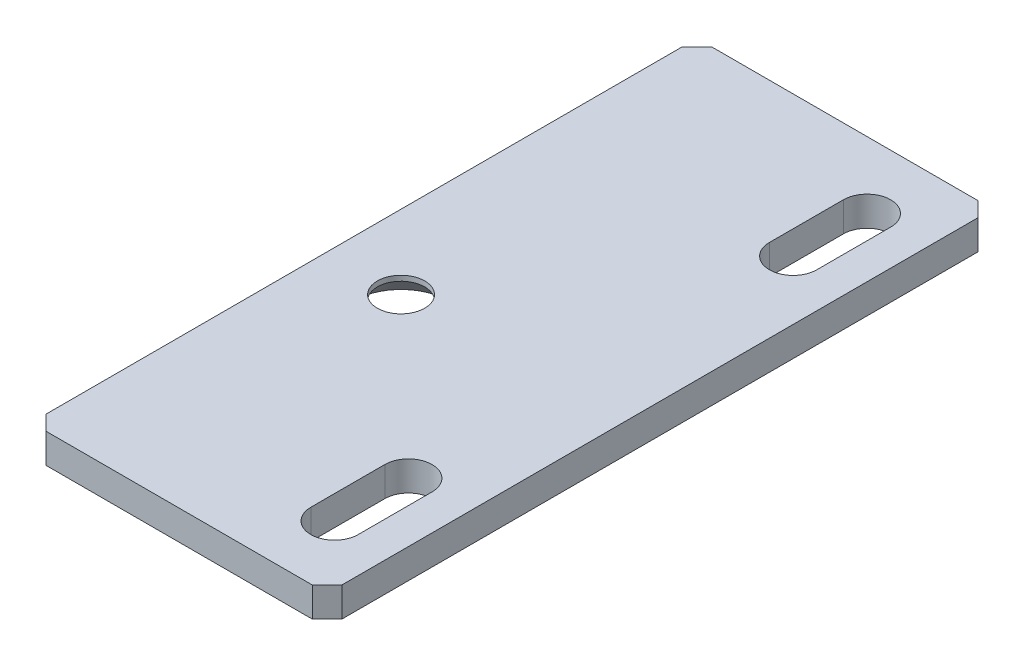
ISO-10303-21;
HEADER;
FILE_DESCRIPTION(('STEP AP214'),'2;1');
FILE_NAME('part.step','',(''),(''),'','','');
FILE_SCHEMA(('AUTOMOTIVE_DESIGN { 1 0 10303 214 1 1 1 1 }'));
ENDSEC;
DATA;
#1=APPLICATION_CONTEXT('core data for automotive mechanical design processes');
#2=APPLICATION_PROTOCOL_DEFINITION('international standard','automotive_design',2000,#1);
#3=PRODUCT_CONTEXT('',#1,'mechanical');
#4=PRODUCT('Part','Part','',(#3));
#5=PRODUCT_RELATED_PRODUCT_CATEGORY('part','',(#4));
#6=PRODUCT_DEFINITION_FORMATION('','',#4);
#7=PRODUCT_DEFINITION_CONTEXT('part definition',#1,'design');
#8=PRODUCT_DEFINITION('design','',#6,#7);
#9=PRODUCT_DEFINITION_SHAPE('','',#8);
#10=(LENGTH_UNIT() NAMED_UNIT(*) SI_UNIT(.MILLI.,.METRE.));
#11=(NAMED_UNIT(*) PLANE_ANGLE_UNIT() SI_UNIT($,.RADIAN.));
#12=(NAMED_UNIT(*) SI_UNIT($,.STERADIAN.) SOLID_ANGLE_UNIT());
#13=UNCERTAINTY_MEASURE_WITH_UNIT(LENGTH_MEASURE(1.E-05),#10,'distance_accuracy_value','');
#14=(GEOMETRIC_REPRESENTATION_CONTEXT(3) GLOBAL_UNCERTAINTY_ASSIGNED_CONTEXT((#13)) GLOBAL_UNIT_ASSIGNED_CONTEXT((#10,
#11,#12)) REPRESENTATION_CONTEXT('',''));
#15=CARTESIAN_POINT('',(0.,0.,0.));
#16=DIRECTION('',(0.,0.,1.));
#17=DIRECTION('',(1.,0.,0.));
#18=AXIS2_PLACEMENT_3D('',#15,#16,#17);
#19=CARTESIAN_POINT('',(-10.,2.,22.5));
#20=DIRECTION('',(1.,0.,0.));
#21=DIRECTION('',(0.,0.,-1.));
#22=AXIS2_PLACEMENT_3D('',#19,#20,#21);
#23=PLANE('',#22);
#24=DIRECTION('',(0.,0.,1.));
#25=VECTOR('',#24,1.);
#26=CARTESIAN_POINT('',(-10.,2.,22.5));
#27=LINE('',#26,#25);
#28=CARTESIAN_POINT('',(-10.,2.,-21.5));
#29=VERTEX_POINT('',#28);
#30=CARTESIAN_POINT('',(-10.,2.,21.5));
#31=VERTEX_POINT('',#30);
#32=EDGE_CURVE('E244',#29,#31,#27,.T.);
#33=ORIENTED_EDGE('',*,*,#32,.F.);
#34=DIRECTION('',(0.,-1.,0.));
#35=VECTOR('',#34,1.);
#36=CARTESIAN_POINT('',(-10.,2.,-21.5));
#37=LINE('',#36,#35);
#38=CARTESIAN_POINT('',(-10.,0.,-21.5));
#39=VERTEX_POINT('',#38);
#40=EDGE_CURVE('E266',#29,#39,#37,.T.);
#41=ORIENTED_EDGE('',*,*,#40,.T.);
#42=DIRECTION('',(0.,0.,1.));
#43=VECTOR('',#42,1.);
#44=CARTESIAN_POINT('',(-10.,0.,22.5));
#45=LINE('',#44,#43);
#46=CARTESIAN_POINT('',(-10.,0.,21.5));
#47=VERTEX_POINT('',#46);
#48=EDGE_CURVE('E209',#39,#47,#45,.T.);
#49=ORIENTED_EDGE('',*,*,#48,.T.);
#50=DIRECTION('',(0.,1.,0.));
#51=VECTOR('',#50,1.);
#52=CARTESIAN_POINT('',(-10.,2.,21.5));
#53=LINE('',#52,#51);
#54=EDGE_CURVE('E255',#47,#31,#53,.T.);
#55=ORIENTED_EDGE('',*,*,#54,.T.);
#56=EDGE_LOOP('',(#33,#41,#49,#55));
#57=FACE_BOUND('',#56,.T.);
#58=ADVANCED_FACE('F50',(#57),#23,.F.);
#59=CARTESIAN_POINT('',(10.,2.,22.5));
#60=DIRECTION('',(0.,0.,-1.));
#61=DIRECTION('',(-1.,0.,0.));
#62=AXIS2_PLACEMENT_3D('',#59,#60,#61);
#63=PLANE('',#62);
#64=DIRECTION('',(1.,0.,0.));
#65=VECTOR('',#64,1.);
#66=CARTESIAN_POINT('',(10.,0.,22.5));
#67=LINE('',#66,#65);
#68=CARTESIAN_POINT('',(-9.,0.,22.5));
#69=VERTEX_POINT('',#68);
#70=CARTESIAN_POINT('',(9.,0.,22.5));
#71=VERTEX_POINT('',#70);
#72=EDGE_CURVE('E258',#69,#71,#67,.T.);
#73=ORIENTED_EDGE('',*,*,#72,.T.);
#74=DIRECTION('',(0.,1.,0.));
#75=VECTOR('',#74,1.);
#76=CARTESIAN_POINT('',(9.,2.,22.5));
#77=LINE('',#76,#75);
#78=CARTESIAN_POINT('',(9.,2.,22.5));
#79=VERTEX_POINT('',#78);
#80=EDGE_CURVE('E13',#71,#79,#77,.T.);
#81=ORIENTED_EDGE('',*,*,#80,.T.);
#82=DIRECTION('',(1.,0.,0.));
#83=VECTOR('',#82,1.);
#84=CARTESIAN_POINT('',(10.,2.,22.5));
#85=LINE('',#84,#83);
#86=CARTESIAN_POINT('',(-9.,2.,22.5));
#87=VERTEX_POINT('',#86);
#88=EDGE_CURVE('E247',#87,#79,#85,.T.);
#89=ORIENTED_EDGE('',*,*,#88,.F.);
#90=DIRECTION('',(0.,-1.,0.));
#91=VECTOR('',#90,1.);
#92=CARTESIAN_POINT('',(-9.,2.,22.5));
#93=LINE('',#92,#91);
#94=EDGE_CURVE('E59',#87,#69,#93,.T.);
#95=ORIENTED_EDGE('',*,*,#94,.T.);
#96=EDGE_LOOP('',(#73,#81,#89,#95));
#97=FACE_BOUND('',#96,.T.);
#98=ADVANCED_FACE('F297',(#97),#63,.F.);
#99=CARTESIAN_POINT('',(10.,2.,22.5));
#100=DIRECTION('',(-1.,0.,0.));
#101=DIRECTION('',(0.,0.,1.));
#102=AXIS2_PLACEMENT_3D('',#99,#100,#101);
#103=PLANE('',#102);
#104=DIRECTION('',(0.,0.,-1.));
#105=VECTOR('',#104,1.);
#106=CARTESIAN_POINT('',(10.,0.,22.5));
#107=LINE('',#106,#105);
#108=CARTESIAN_POINT('',(10.,0.,21.5));
#109=VERTEX_POINT('',#108);
#110=CARTESIAN_POINT('',(10.,0.,-21.5));
#111=VERTEX_POINT('',#110);
#112=EDGE_CURVE('E261',#109,#111,#107,.T.);
#113=ORIENTED_EDGE('',*,*,#112,.T.);
#114=DIRECTION('',(0.,1.,0.));
#115=VECTOR('',#114,1.);
#116=CARTESIAN_POINT('',(10.,2.,-21.5));
#117=LINE('',#116,#115);
#118=CARTESIAN_POINT('',(10.,2.,-21.5));
#119=VERTEX_POINT('',#118);
#120=EDGE_CURVE('E66',#111,#119,#117,.T.);
#121=ORIENTED_EDGE('',*,*,#120,.T.);
#122=DIRECTION('',(0.,0.,-1.));
#123=VECTOR('',#122,1.);
#124=CARTESIAN_POINT('',(10.,2.,22.5));
#125=LINE('',#124,#123);
#126=CARTESIAN_POINT('',(10.,2.,21.5));
#127=VERTEX_POINT('',#126);
#128=EDGE_CURVE('E250',#127,#119,#125,.T.);
#129=ORIENTED_EDGE('',*,*,#128,.F.);
#130=DIRECTION('',(0.,-1.,0.));
#131=VECTOR('',#130,1.);
#132=CARTESIAN_POINT('',(10.,2.,21.5));
#133=LINE('',#132,#131);
#134=EDGE_CURVE('E289',#127,#109,#133,.T.);
#135=ORIENTED_EDGE('',*,*,#134,.T.);
#136=EDGE_LOOP('',(#113,#121,#129,#135));
#137=FACE_BOUND('',#136,.T.);
#138=ADVANCED_FACE('F307',(#137),#103,.F.);
#139=CARTESIAN_POINT('',(10.,2.,-22.5));
#140=DIRECTION('',(0.,0.,1.));
#141=DIRECTION('',(1.,0.,0.));
#142=AXIS2_PLACEMENT_3D('',#139,#140,#141);
#143=PLANE('',#142);
#144=DIRECTION('',(-1.,0.,0.));
#145=VECTOR('',#144,1.);
#146=CARTESIAN_POINT('',(10.,0.,-22.5));
#147=LINE('',#146,#145);
#148=CARTESIAN_POINT('',(9.,0.,-22.5));
#149=VERTEX_POINT('',#148);
#150=CARTESIAN_POINT('',(-9.,0.,-22.5));
#151=VERTEX_POINT('',#150);
#152=EDGE_CURVE('E248',#149,#151,#147,.T.);
#153=ORIENTED_EDGE('',*,*,#152,.T.);
#154=DIRECTION('',(0.,1.,0.));
#155=VECTOR('',#154,1.);
#156=CARTESIAN_POINT('',(-9.,2.,-22.5));
#157=LINE('',#156,#155);
#158=CARTESIAN_POINT('',(-9.,2.,-22.5));
#159=VERTEX_POINT('',#158);
#160=EDGE_CURVE('E280',#151,#159,#157,.T.);
#161=ORIENTED_EDGE('',*,*,#160,.T.);
#162=DIRECTION('',(-1.,0.,0.));
#163=VECTOR('',#162,1.);
#164=CARTESIAN_POINT('',(10.,2.,-22.5));
#165=LINE('',#164,#163);
#166=CARTESIAN_POINT('',(9.,2.,-22.5));
#167=VERTEX_POINT('',#166);
#168=EDGE_CURVE('E252',#167,#159,#165,.T.);
#169=ORIENTED_EDGE('',*,*,#168,.F.);
#170=DIRECTION('',(0.,-1.,0.));
#171=VECTOR('',#170,1.);
#172=CARTESIAN_POINT('',(9.,2.,-22.5));
#173=LINE('',#172,#171);
#174=EDGE_CURVE('E277',#167,#149,#173,.T.);
#175=ORIENTED_EDGE('',*,*,#174,.T.);
#176=EDGE_LOOP('',(#153,#161,#169,#175));
#177=FACE_BOUND('',#176,.T.);
#178=ADVANCED_FACE('F316',(#177),#143,.F.);
#179=CARTESIAN_POINT('',(0.,2.,0.));
#180=DIRECTION('',(0.,1.,0.));
#181=DIRECTION('',(0.,0.,1.));
#182=AXIS2_PLACEMENT_3D('',#179,#180,#181);
#183=PLANE('',#182);
#184=CARTESIAN_POINT('',(-5.,2.,2.5));
#185=DIRECTION('',(0.,-1.,0.));
#186=DIRECTION('',(0.,0.,-1.));
#187=AXIS2_PLACEMENT_3D('',#184,#185,#186);
#188=CIRCLE('',#187,1.6);
#189=CARTESIAN_POINT('',(-5.,2.,0.900000000000002));
#190=VERTEX_POINT('',#189);
#191=EDGE_CURVE('E196',#190,#190,#188,.T.);
#192=ORIENTED_EDGE('',*,*,#191,.T.);
#193=EDGE_LOOP('',(#192));
#194=FACE_BOUND('',#193,.T.);
#195=CARTESIAN_POINT('',(5.99999999999999,2.,-18.));
#196=DIRECTION('',(0.,1.,0.));
#197=DIRECTION('',(0.,0.,1.));
#198=AXIS2_PLACEMENT_3D('',#195,#196,#197);
#199=CIRCLE('',#198,1.6);
#200=CARTESIAN_POINT('',(7.6,2.,-18.));
#201=VERTEX_POINT('',#200);
#202=CARTESIAN_POINT('',(4.4,2.,-18.));
#203=VERTEX_POINT('',#202);
#204=EDGE_CURVE('E172',#201,#203,#199,.T.);
#205=ORIENTED_EDGE('',*,*,#204,.F.);
#206=DIRECTION('',(0.,0.,-1.));
#207=VECTOR('',#206,1.);
#208=CARTESIAN_POINT('',(7.6,2.,-18.));
#209=LINE('',#208,#207);
#210=CARTESIAN_POINT('',(7.6,2.,-13.));
#211=VERTEX_POINT('',#210);
#212=EDGE_CURVE('E190',#211,#201,#209,.T.);
#213=ORIENTED_EDGE('',*,*,#212,.F.);
#214=CARTESIAN_POINT('',(5.99999999999999,2.,-13.));
#215=DIRECTION('',(0.,1.,0.));
#216=DIRECTION('',(0.,0.,1.));
#217=AXIS2_PLACEMENT_3D('',#214,#215,#216);
#218=CIRCLE('',#217,1.6);
#219=CARTESIAN_POINT('',(4.39999999999999,2.,-13.));
#220=VERTEX_POINT('',#219);
#221=EDGE_CURVE('E193',#220,#211,#218,.T.);
#222=ORIENTED_EDGE('',*,*,#221,.F.);
#223=DIRECTION('',(0.,0.,1.));
#224=VECTOR('',#223,1.);
#225=CARTESIAN_POINT('',(4.4,2.,-18.));
#226=LINE('',#225,#224);
#227=EDGE_CURVE('E202',#203,#220,#226,.T.);
#228=ORIENTED_EDGE('',*,*,#227,.F.);
#229=EDGE_LOOP('',(#205,#213,#222,#228));
#230=FACE_BOUND('',#229,.T.);
#231=CARTESIAN_POINT('',(6.,2.,13.));
#232=DIRECTION('',(0.,1.,0.));
#233=DIRECTION('',(0.,0.,1.));
#234=AXIS2_PLACEMENT_3D('',#231,#232,#233);
#235=CIRCLE('',#234,1.6);
#236=CARTESIAN_POINT('',(7.6,2.,13.));
#237=VERTEX_POINT('',#236);
#238=CARTESIAN_POINT('',(4.4,2.,13.));
#239=VERTEX_POINT('',#238);
#240=EDGE_CURVE('E227',#237,#239,#235,.T.);
#241=ORIENTED_EDGE('',*,*,#240,.F.);
#242=DIRECTION('',(0.,0.,-1.));
#243=VECTOR('',#242,1.);
#244=CARTESIAN_POINT('',(7.6,2.,13.));
#245=LINE('',#244,#243);
#246=CARTESIAN_POINT('',(7.6,2.,18.));
#247=VERTEX_POINT('',#246);
#248=EDGE_CURVE('E217',#247,#237,#245,.T.);
#249=ORIENTED_EDGE('',*,*,#248,.F.);
#250=CARTESIAN_POINT('',(6.,2.,18.));
#251=DIRECTION('',(0.,1.,0.));
#252=DIRECTION('',(0.,0.,1.));
#253=AXIS2_PLACEMENT_3D('',#250,#251,#252);
#254=CIRCLE('',#253,1.6);
#255=CARTESIAN_POINT('',(4.4,2.,18.));
#256=VERTEX_POINT('',#255);
#257=EDGE_CURVE('E232',#256,#247,#254,.T.);
#258=ORIENTED_EDGE('',*,*,#257,.F.);
#259=DIRECTION('',(0.,0.,1.));
#260=VECTOR('',#259,1.);
#261=CARTESIAN_POINT('',(4.4,2.,13.));
#262=LINE('',#261,#260);
#263=EDGE_CURVE('E229',#239,#256,#262,.T.);
#264=ORIENTED_EDGE('',*,*,#263,.F.);
#265=EDGE_LOOP('',(#241,#249,#258,#264));
#266=FACE_BOUND('',#265,.T.);
#267=ORIENTED_EDGE('',*,*,#168,.T.);
#268=DIRECTION('',(0.707106781186551,0.,-0.707106781186544));
#269=VECTOR('',#268,1.);
#270=CARTESIAN_POINT('',(-15.75,2.,-15.7500000000001));
#271=LINE('',#270,#269);
#272=EDGE_CURVE('E287',#159,#29,#271,.F.);
#273=ORIENTED_EDGE('',*,*,#272,.T.);
#274=ORIENTED_EDGE('',*,*,#32,.T.);
#275=DIRECTION('',(-0.707106781186546,0.,-0.707106781186549));
#276=VECTOR('',#275,1.);
#277=CARTESIAN_POINT('',(-15.75,2.,15.7499999999999));
#278=LINE('',#277,#276);
#279=EDGE_CURVE('E282',#31,#87,#278,.F.);
#280=ORIENTED_EDGE('',*,*,#279,.T.);
#281=ORIENTED_EDGE('',*,*,#88,.T.);
#282=DIRECTION('',(-0.70710678118655,0.,0.707106781186545));
#283=VECTOR('',#282,1.);
#284=CARTESIAN_POINT('',(15.75,2.,15.7500000000001));
#285=LINE('',#284,#283);
#286=EDGE_CURVE('E73',#79,#127,#285,.F.);
#287=ORIENTED_EDGE('',*,*,#286,.T.);
#288=ORIENTED_EDGE('',*,*,#128,.T.);
#289=DIRECTION('',(0.707106781186545,0.,0.70710678118655));
#290=VECTOR('',#289,1.);
#291=CARTESIAN_POINT('',(15.75,2.,-15.7499999999999));
#292=LINE('',#291,#290);
#293=EDGE_CURVE('E285',#119,#167,#292,.F.);
#294=ORIENTED_EDGE('',*,*,#293,.T.);
#295=EDGE_LOOP('',(#267,#273,#274,#280,#281,#287,#288,#294));
#296=FACE_BOUND('',#295,.T.);
#297=ADVANCED_FACE('F309',(#194,#230,#266,#296),#183,.T.);
#298=CARTESIAN_POINT('',(0.,0.,0.));
#299=DIRECTION('',(0.,1.,0.));
#300=DIRECTION('',(0.,0.,1.));
#301=AXIS2_PLACEMENT_3D('',#298,#299,#300);
#302=PLANE('',#301);
#303=CARTESIAN_POINT('',(-5.,0.,2.5));
#304=DIRECTION('',(0.,-1.,0.));
#305=DIRECTION('',(0.,0.,-1.));
#306=AXIS2_PLACEMENT_3D('',#303,#304,#305);
#307=CIRCLE('',#306,3.25);
#308=CARTESIAN_POINT('',(-5.,0.,-0.75));
#309=VERTEX_POINT('',#308);
#310=EDGE_CURVE('E528',#309,#309,#307,.T.);
#311=ORIENTED_EDGE('',*,*,#310,.F.);
#312=EDGE_LOOP('',(#311));
#313=FACE_BOUND('',#312,.T.);
#314=DIRECTION('',(0.,0.,-1.));
#315=VECTOR('',#314,1.);
#316=CARTESIAN_POINT('',(7.6,0.,-18.));
#317=LINE('',#316,#315);
#318=CARTESIAN_POINT('',(7.6,0.,-13.));
#319=VERTEX_POINT('',#318);
#320=CARTESIAN_POINT('',(7.6,0.,-18.));
#321=VERTEX_POINT('',#320);
#322=EDGE_CURVE('E177',#319,#321,#317,.T.);
#323=ORIENTED_EDGE('',*,*,#322,.T.);
#324=CARTESIAN_POINT('',(5.99999999999999,0.,-18.));
#325=DIRECTION('',(0.,1.,0.));
#326=DIRECTION('',(0.,0.,1.));
#327=AXIS2_PLACEMENT_3D('',#324,#325,#326);
#328=CIRCLE('',#327,1.6);
#329=CARTESIAN_POINT('',(4.4,0.,-18.));
#330=VERTEX_POINT('',#329);
#331=EDGE_CURVE('E169',#321,#330,#328,.T.);
#332=ORIENTED_EDGE('',*,*,#331,.T.);
#333=DIRECTION('',(0.,0.,1.));
#334=VECTOR('',#333,1.);
#335=CARTESIAN_POINT('',(4.4,0.,-18.));
#336=LINE('',#335,#334);
#337=CARTESIAN_POINT('',(4.4,0.,-13.));
#338=VERTEX_POINT('',#337);
#339=EDGE_CURVE('E181',#330,#338,#336,.T.);
#340=ORIENTED_EDGE('',*,*,#339,.T.);
#341=CARTESIAN_POINT('',(5.99999999999999,0.,-13.));
#342=DIRECTION('',(0.,1.,0.));
#343=DIRECTION('',(0.,0.,1.));
#344=AXIS2_PLACEMENT_3D('',#341,#342,#343);
#345=CIRCLE('',#344,1.6);
#346=EDGE_CURVE('E185',#338,#319,#345,.T.);
#347=ORIENTED_EDGE('',*,*,#346,.T.);
#348=EDGE_LOOP('',(#323,#332,#340,#347));
#349=FACE_BOUND('',#348,.T.);
#350=DIRECTION('',(0.,0.,-1.));
#351=VECTOR('',#350,1.);
#352=CARTESIAN_POINT('',(7.6,0.,13.));
#353=LINE('',#352,#351);
#354=CARTESIAN_POINT('',(7.6,0.,18.));
#355=VERTEX_POINT('',#354);
#356=CARTESIAN_POINT('',(7.6,0.,13.));
#357=VERTEX_POINT('',#356);
#358=EDGE_CURVE('E223',#355,#357,#353,.T.);
#359=ORIENTED_EDGE('',*,*,#358,.T.);
#360=CARTESIAN_POINT('',(6.,0.,13.));
#361=DIRECTION('',(0.,1.,0.));
#362=DIRECTION('',(0.,0.,1.));
#363=AXIS2_PLACEMENT_3D('',#360,#361,#362);
#364=CIRCLE('',#363,1.6);
#365=CARTESIAN_POINT('',(4.4,0.,13.));
#366=VERTEX_POINT('',#365);
#367=EDGE_CURVE('E213',#357,#366,#364,.T.);
#368=ORIENTED_EDGE('',*,*,#367,.T.);
#369=DIRECTION('',(0.,0.,1.));
#370=VECTOR('',#369,1.);
#371=CARTESIAN_POINT('',(4.4,0.,13.));
#372=LINE('',#371,#370);
#373=CARTESIAN_POINT('',(4.4,0.,18.));
#374=VERTEX_POINT('',#373);
#375=EDGE_CURVE('E216',#366,#374,#372,.T.);
#376=ORIENTED_EDGE('',*,*,#375,.T.);
#377=CARTESIAN_POINT('',(6.,0.,18.));
#378=DIRECTION('',(0.,1.,0.));
#379=DIRECTION('',(0.,0.,1.));
#380=AXIS2_PLACEMENT_3D('',#377,#378,#379);
#381=CIRCLE('',#380,1.6);
#382=EDGE_CURVE('E220',#374,#355,#381,.T.);
#383=ORIENTED_EDGE('',*,*,#382,.T.);
#384=EDGE_LOOP('',(#359,#368,#376,#383));
#385=FACE_BOUND('',#384,.T.);
#386=ORIENTED_EDGE('',*,*,#48,.F.);
#387=DIRECTION('',(-0.707106781186551,0.,0.707106781186544));
#388=VECTOR('',#387,1.);
#389=CARTESIAN_POINT('',(-10.,0.,-21.5));
#390=LINE('',#389,#388);
#391=EDGE_CURVE('E275',#39,#151,#390,.F.);
#392=ORIENTED_EDGE('',*,*,#391,.T.);
#393=ORIENTED_EDGE('',*,*,#152,.F.);
#394=DIRECTION('',(-0.707106781186545,0.,-0.70710678118655));
#395=VECTOR('',#394,1.);
#396=CARTESIAN_POINT('',(9.,0.,-22.5));
#397=LINE('',#396,#395);
#398=EDGE_CURVE('E273',#149,#111,#397,.F.);
#399=ORIENTED_EDGE('',*,*,#398,.T.);
#400=ORIENTED_EDGE('',*,*,#112,.F.);
#401=DIRECTION('',(0.70710678118655,0.,-0.707106781186545));
#402=VECTOR('',#401,1.);
#403=CARTESIAN_POINT('',(10.,0.,21.5));
#404=LINE('',#403,#402);
#405=EDGE_CURVE('E271',#109,#71,#404,.F.);
#406=ORIENTED_EDGE('',*,*,#405,.T.);
#407=ORIENTED_EDGE('',*,*,#72,.F.);
#408=DIRECTION('',(0.707106781186546,0.,0.707106781186549));
#409=VECTOR('',#408,1.);
#410=CARTESIAN_POINT('',(-9.,0.,22.5));
#411=LINE('',#410,#409);
#412=EDGE_CURVE('E269',#69,#47,#411,.F.);
#413=ORIENTED_EDGE('',*,*,#412,.T.);
#414=EDGE_LOOP('',(#386,#392,#393,#399,#400,#406,#407,#413));
#415=FACE_BOUND('',#414,.T.);
#416=ADVANCED_FACE('F187',(#313,#349,#385,#415),#302,.F.);
#417=CARTESIAN_POINT('',(6.,0.,13.));
#418=DIRECTION('',(0.,1.,0.));
#419=DIRECTION('',(0.,0.,1.));
#420=AXIS2_PLACEMENT_3D('',#417,#418,#419);
#421=CYLINDRICAL_SURFACE('',#420,1.6);
#422=ORIENTED_EDGE('',*,*,#240,.T.);
#423=DIRECTION('',(0.,1.,0.));
#424=VECTOR('',#423,1.);
#425=CARTESIAN_POINT('',(4.4,0.,13.));
#426=LINE('',#425,#424);
#427=EDGE_CURVE('E226',#366,#239,#426,.T.);
#428=ORIENTED_EDGE('',*,*,#427,.F.);
#429=ORIENTED_EDGE('',*,*,#367,.F.);
#430=DIRECTION('',(0.,1.,0.));
#431=VECTOR('',#430,1.);
#432=CARTESIAN_POINT('',(7.6,0.,13.));
#433=LINE('',#432,#431);
#434=EDGE_CURVE('E203',#357,#237,#433,.T.);
#435=ORIENTED_EDGE('',*,*,#434,.T.);
#436=EDGE_LOOP('',(#422,#428,#429,#435));
#437=FACE_BOUND('',#436,.T.);
#438=ADVANCED_FACE('F449',(#437),#421,.F.);
#439=CARTESIAN_POINT('',(7.6,0.,13.));
#440=DIRECTION('',(1.,0.,0.));
#441=DIRECTION('',(0.,0.,-1.));
#442=AXIS2_PLACEMENT_3D('',#439,#440,#441);
#443=PLANE('',#442);
#444=ORIENTED_EDGE('',*,*,#248,.T.);
#445=ORIENTED_EDGE('',*,*,#434,.F.);
#446=ORIENTED_EDGE('',*,*,#358,.F.);
#447=DIRECTION('',(0.,1.,0.));
#448=VECTOR('',#447,1.);
#449=CARTESIAN_POINT('',(7.6,0.,18.));
#450=LINE('',#449,#448);
#451=EDGE_CURVE('E238',#355,#247,#450,.T.);
#452=ORIENTED_EDGE('',*,*,#451,.T.);
#453=EDGE_LOOP('',(#444,#445,#446,#452));
#454=FACE_BOUND('',#453,.T.);
#455=ADVANCED_FACE('F440',(#454),#443,.F.);
#456=CARTESIAN_POINT('',(6.,0.,18.));
#457=DIRECTION('',(0.,1.,0.));
#458=DIRECTION('',(0.,0.,1.));
#459=AXIS2_PLACEMENT_3D('',#456,#457,#458);
#460=CYLINDRICAL_SURFACE('',#459,1.6);
#461=ORIENTED_EDGE('',*,*,#257,.T.);
#462=ORIENTED_EDGE('',*,*,#451,.F.);
#463=ORIENTED_EDGE('',*,*,#382,.F.);
#464=DIRECTION('',(0.,1.,0.));
#465=VECTOR('',#464,1.);
#466=CARTESIAN_POINT('',(4.4,0.,18.));
#467=LINE('',#466,#465);
#468=EDGE_CURVE('E240',#374,#256,#467,.T.);
#469=ORIENTED_EDGE('',*,*,#468,.T.);
#470=EDGE_LOOP('',(#461,#462,#463,#469));
#471=FACE_BOUND('',#470,.T.);
#472=ADVANCED_FACE('F431',(#471),#460,.F.);
#473=CARTESIAN_POINT('',(4.4,0.,13.));
#474=DIRECTION('',(-1.,0.,0.));
#475=DIRECTION('',(0.,0.,1.));
#476=AXIS2_PLACEMENT_3D('',#473,#474,#475);
#477=PLANE('',#476);
#478=ORIENTED_EDGE('',*,*,#263,.T.);
#479=ORIENTED_EDGE('',*,*,#468,.F.);
#480=ORIENTED_EDGE('',*,*,#375,.F.);
#481=ORIENTED_EDGE('',*,*,#427,.T.);
#482=EDGE_LOOP('',(#478,#479,#480,#481));
#483=FACE_BOUND('',#482,.T.);
#484=ADVANCED_FACE('F423',(#483),#477,.F.);
#485=CARTESIAN_POINT('',(5.99999999999999,0.,-18.));
#486=DIRECTION('',(0.,1.,0.));
#487=DIRECTION('',(0.,0.,1.));
#488=AXIS2_PLACEMENT_3D('',#485,#486,#487);
#489=CYLINDRICAL_SURFACE('',#488,1.6);
#490=ORIENTED_EDGE('',*,*,#204,.T.);
#491=DIRECTION('',(0.,1.,0.));
#492=VECTOR('',#491,1.);
#493=CARTESIAN_POINT('',(4.4,0.,-18.));
#494=LINE('',#493,#492);
#495=EDGE_CURVE('E165',#330,#203,#494,.T.);
#496=ORIENTED_EDGE('',*,*,#495,.F.);
#497=ORIENTED_EDGE('',*,*,#331,.F.);
#498=DIRECTION('',(0.,1.,0.));
#499=VECTOR('',#498,1.);
#500=CARTESIAN_POINT('',(7.6,0.,-18.));
#501=LINE('',#500,#499);
#502=EDGE_CURVE('E207',#321,#201,#501,.T.);
#503=ORIENTED_EDGE('',*,*,#502,.T.);
#504=EDGE_LOOP('',(#490,#496,#497,#503));
#505=FACE_BOUND('',#504,.T.);
#506=ADVANCED_FACE('F167',(#505),#489,.F.);
#507=CARTESIAN_POINT('',(7.6,0.,-18.));
#508=DIRECTION('',(1.,0.,0.));
#509=DIRECTION('',(0.,0.,-1.));
#510=AXIS2_PLACEMENT_3D('',#507,#508,#509);
#511=PLANE('',#510);
#512=ORIENTED_EDGE('',*,*,#212,.T.);
#513=ORIENTED_EDGE('',*,*,#502,.F.);
#514=ORIENTED_EDGE('',*,*,#322,.F.);
#515=DIRECTION('',(0.,1.,0.));
#516=VECTOR('',#515,1.);
#517=CARTESIAN_POINT('',(7.6,0.,-13.));
#518=LINE('',#517,#516);
#519=EDGE_CURVE('E210',#319,#211,#518,.T.);
#520=ORIENTED_EDGE('',*,*,#519,.T.);
#521=EDGE_LOOP('',(#512,#513,#514,#520));
#522=FACE_BOUND('',#521,.T.);
#523=ADVANCED_FACE('F406',(#522),#511,.F.);
#524=CARTESIAN_POINT('',(5.99999999999999,0.,-13.));
#525=DIRECTION('',(0.,1.,0.));
#526=DIRECTION('',(0.,0.,1.));
#527=AXIS2_PLACEMENT_3D('',#524,#525,#526);
#528=CYLINDRICAL_SURFACE('',#527,1.6);
#529=ORIENTED_EDGE('',*,*,#221,.T.);
#530=ORIENTED_EDGE('',*,*,#519,.F.);
#531=ORIENTED_EDGE('',*,*,#346,.F.);
#532=DIRECTION('',(0.,1.,0.));
#533=VECTOR('',#532,1.);
#534=CARTESIAN_POINT('',(4.39999999999999,0.,-13.));
#535=LINE('',#534,#533);
#536=EDGE_CURVE('E176',#338,#220,#535,.T.);
#537=ORIENTED_EDGE('',*,*,#536,.T.);
#538=EDGE_LOOP('',(#529,#530,#531,#537));
#539=FACE_BOUND('',#538,.T.);
#540=ADVANCED_FACE('F398',(#539),#528,.F.);
#541=CARTESIAN_POINT('',(4.4,0.,-18.));
#542=DIRECTION('',(-1.,0.,0.));
#543=DIRECTION('',(0.,0.,1.));
#544=AXIS2_PLACEMENT_3D('',#541,#542,#543);
#545=PLANE('',#544);
#546=ORIENTED_EDGE('',*,*,#227,.T.);
#547=ORIENTED_EDGE('',*,*,#536,.F.);
#548=ORIENTED_EDGE('',*,*,#339,.F.);
#549=ORIENTED_EDGE('',*,*,#495,.T.);
#550=EDGE_LOOP('',(#546,#547,#548,#549));
#551=FACE_BOUND('',#550,.T.);
#552=ADVANCED_FACE('F182',(#551),#545,.F.);
#553=CARTESIAN_POINT('',(-5.,0.,2.5));
#554=DIRECTION('',(0.,-1.,0.));
#555=DIRECTION('',(0.,0.,-1.));
#556=AXIS2_PLACEMENT_3D('',#553,#554,#555);
#557=CYLINDRICAL_SURFACE('',#556,1.6);
#558=ORIENTED_EDGE('',*,*,#191,.F.);
#559=EDGE_LOOP('',(#558));
#560=FACE_BOUND('',#559,.T.);
#561=CARTESIAN_POINT('',(-5.,1.65,2.5));
#562=DIRECTION('',(0.,-1.,0.));
#563=DIRECTION('',(0.,0.,-1.));
#564=AXIS2_PLACEMENT_3D('',#561,#562,#563);
#565=CIRCLE('',#564,1.6);
#566=CARTESIAN_POINT('',(-5.,1.65,0.9));
#567=VERTEX_POINT('',#566);
#568=EDGE_CURVE('E526',#567,#567,#565,.T.);
#569=ORIENTED_EDGE('',*,*,#568,.T.);
#570=EDGE_LOOP('',(#569));
#571=FACE_BOUND('',#570,.T.);
#572=ADVANCED_FACE('F381',(#560,#571),#557,.F.);
#573=CARTESIAN_POINT('',(-5.,0.,2.5));
#574=DIRECTION('',(0.,-1.,0.));
#575=DIRECTION('',(0.,0.,-1.));
#576=AXIS2_PLACEMENT_3D('',#573,#574,#575);
#577=CONICAL_SURFACE('',#576,3.25,0.785398163397449);
#578=ORIENTED_EDGE('',*,*,#568,.F.);
#579=EDGE_LOOP('',(#578));
#580=FACE_BOUND('',#579,.T.);
#581=ORIENTED_EDGE('',*,*,#310,.T.);
#582=EDGE_LOOP('',(#581));
#583=FACE_BOUND('',#582,.T.);
#584=ADVANCED_FACE('F343',(#580,#583),#577,.F.);
#585=CARTESIAN_POINT('',(-10.,2.,-21.5));
#586=DIRECTION('',(0.707106781186544,0.,0.707106781186551));
#587=DIRECTION('',(0.,-1.,0.));
#588=AXIS2_PLACEMENT_3D('',#585,#586,#587);
#589=PLANE('',#588);
#590=ORIENTED_EDGE('',*,*,#272,.F.);
#591=ORIENTED_EDGE('',*,*,#160,.F.);
#592=ORIENTED_EDGE('',*,*,#391,.F.);
#593=ORIENTED_EDGE('',*,*,#40,.F.);
#594=EDGE_LOOP('',(#590,#591,#592,#593));
#595=FACE_BOUND('',#594,.T.);
#596=ADVANCED_FACE('F321',(#595),#589,.F.);
#597=CARTESIAN_POINT('',(9.,2.,-22.5));
#598=DIRECTION('',(-0.70710678118655,0.,0.707106781186545));
#599=DIRECTION('',(0.,-1.,0.));
#600=AXIS2_PLACEMENT_3D('',#597,#598,#599);
#601=PLANE('',#600);
#602=ORIENTED_EDGE('',*,*,#293,.F.);
#603=ORIENTED_EDGE('',*,*,#120,.F.);
#604=ORIENTED_EDGE('',*,*,#398,.F.);
#605=ORIENTED_EDGE('',*,*,#174,.F.);
#606=EDGE_LOOP('',(#602,#603,#604,#605));
#607=FACE_BOUND('',#606,.T.);
#608=ADVANCED_FACE('F313',(#607),#601,.F.);
#609=CARTESIAN_POINT('',(10.,2.,21.5));
#610=DIRECTION('',(-0.707106781186545,0.,-0.70710678118655));
#611=DIRECTION('',(0.,-1.,0.));
#612=AXIS2_PLACEMENT_3D('',#609,#610,#611);
#613=PLANE('',#612);
#614=ORIENTED_EDGE('',*,*,#286,.F.);
#615=ORIENTED_EDGE('',*,*,#80,.F.);
#616=ORIENTED_EDGE('',*,*,#405,.F.);
#617=ORIENTED_EDGE('',*,*,#134,.F.);
#618=EDGE_LOOP('',(#614,#615,#616,#617));
#619=FACE_BOUND('',#618,.T.);
#620=ADVANCED_FACE('F306',(#619),#613,.F.);
#621=CARTESIAN_POINT('',(-9.,2.,22.5));
#622=DIRECTION('',(0.707106781186549,0.,-0.707106781186546));
#623=DIRECTION('',(0.,-1.,0.));
#624=AXIS2_PLACEMENT_3D('',#621,#622,#623);
#625=PLANE('',#624);
#626=ORIENTED_EDGE('',*,*,#279,.F.);
#627=ORIENTED_EDGE('',*,*,#54,.F.);
#628=ORIENTED_EDGE('',*,*,#412,.F.);
#629=ORIENTED_EDGE('',*,*,#94,.F.);
#630=EDGE_LOOP('',(#626,#627,#628,#629));
#631=FACE_BOUND('',#630,.T.);
#632=ADVANCED_FACE('F53',(#631),#625,.F.);
#633=CLOSED_SHELL('',(#58,#98,#138,#178,#297,#416,#438,#455,#472,#484,#506,#523,#540,#552,#572,
#584,#596,#608,#620,#632));
#634=MANIFOLD_SOLID_BREP('B2',#633);
#635=ADVANCED_BREP_SHAPE_REPRESENTATION('',(#18,#634),#14);
#636=SHAPE_DEFINITION_REPRESENTATION(#9,#635);
ENDSEC;
END-ISO-10303-21;
